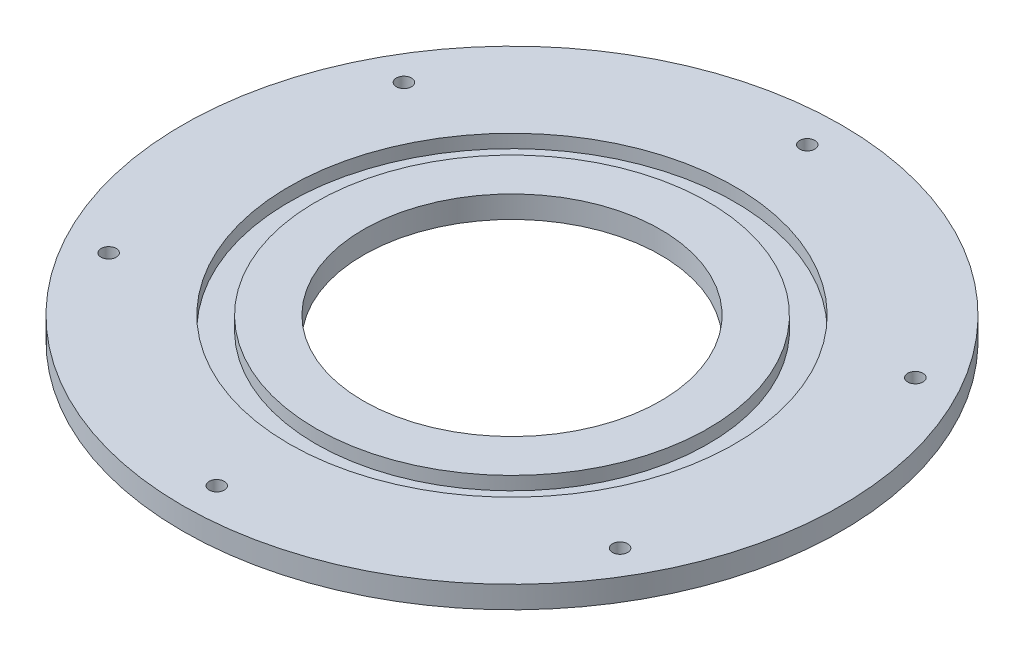
ISO-10303-21;
HEADER;
FILE_DESCRIPTION(('STEP AP214'),'2;1');
FILE_NAME('part.step','',(''),(''),'','','');
FILE_SCHEMA(('AUTOMOTIVE_DESIGN { 1 0 10303 214 1 1 1 1 }'));
ENDSEC;
DATA;
#1=APPLICATION_CONTEXT('core data for automotive mechanical design processes');
#2=APPLICATION_PROTOCOL_DEFINITION('international standard','automotive_design',2000,#1);
#3=PRODUCT_CONTEXT('',#1,'mechanical');
#4=PRODUCT('Part','Part','',(#3));
#5=PRODUCT_RELATED_PRODUCT_CATEGORY('part','',(#4));
#6=PRODUCT_DEFINITION_FORMATION('','',#4);
#7=PRODUCT_DEFINITION_CONTEXT('part definition',#1,'design');
#8=PRODUCT_DEFINITION('design','',#6,#7);
#9=PRODUCT_DEFINITION_SHAPE('','',#8);
#10=(LENGTH_UNIT() NAMED_UNIT(*) SI_UNIT(.MILLI.,.METRE.));
#11=(NAMED_UNIT(*) PLANE_ANGLE_UNIT() SI_UNIT($,.RADIAN.));
#12=(NAMED_UNIT(*) SI_UNIT($,.STERADIAN.) SOLID_ANGLE_UNIT());
#13=UNCERTAINTY_MEASURE_WITH_UNIT(LENGTH_MEASURE(1.E-05),#10,'distance_accuracy_value','');
#14=(GEOMETRIC_REPRESENTATION_CONTEXT(3) GLOBAL_UNCERTAINTY_ASSIGNED_CONTEXT((#13)) GLOBAL_UNIT_ASSIGNED_CONTEXT((#10,
#11,#12)) REPRESENTATION_CONTEXT('',''));
#15=CARTESIAN_POINT('',(0.,0.,0.));
#16=DIRECTION('',(0.,0.,1.));
#17=DIRECTION('',(1.,0.,0.));
#18=AXIS2_PLACEMENT_3D('',#15,#16,#17);
#19=CARTESIAN_POINT('',(0.,5.8,0.));
#20=DIRECTION('',(0.,1.,0.));
#21=DIRECTION('',(0.,0.,1.));
#22=AXIS2_PLACEMENT_3D('',#19,#20,#21);
#23=PLANE('',#22);
#24=CARTESIAN_POINT('',(0.,5.8,0.));
#25=DIRECTION('',(0.,1.,0.));
#26=DIRECTION('',(0.,0.,1.));
#27=AXIS2_PLACEMENT_3D('',#24,#25,#26);
#28=CIRCLE('',#27,39.);
#29=CARTESIAN_POINT('',(0.,5.8,39.));
#30=VERTEX_POINT('',#29);
#31=EDGE_CURVE('E43',#30,#30,#28,.T.);
#32=ORIENTED_EDGE('',*,*,#31,.F.);
#33=EDGE_LOOP('',(#32));
#34=FACE_BOUND('',#33,.T.);
#35=CARTESIAN_POINT('',(0.,5.8,0.));
#36=DIRECTION('',(0.,1.,0.));
#37=DIRECTION('',(0.,0.,1.));
#38=AXIS2_PLACEMENT_3D('',#35,#36,#37);
#39=CIRCLE('',#38,51.5);
#40=CARTESIAN_POINT('',(0.,5.8,51.5));
#41=VERTEX_POINT('',#40);
#42=EDGE_CURVE('E57',#41,#41,#39,.T.);
#43=ORIENTED_EDGE('',*,*,#42,.T.);
#44=EDGE_LOOP('',(#43));
#45=FACE_BOUND('',#44,.T.);
#46=ADVANCED_FACE('F32',(#34,#45),#23,.T.);
#47=CARTESIAN_POINT('',(0.,5.8,-77.5));
#48=DIRECTION('',(0.,1.,0.));
#49=DIRECTION('',(0.,0.,1.));
#50=AXIS2_PLACEMENT_3D('',#47,#48,#49);
#51=CIRCLE('',#50,2.);
#52=CARTESIAN_POINT('',(0.,5.8,-75.5));
#53=VERTEX_POINT('',#52);
#54=EDGE_CURVE('E88',#53,#53,#51,.T.);
#55=ORIENTED_EDGE('',*,*,#54,.F.);
#56=EDGE_LOOP('',(#55));
#57=FACE_BOUND('',#56,.T.);
#58=CARTESIAN_POINT('',(-67.1169687932928,5.8,-38.7499999999979));
#59=DIRECTION('',(0.,1.,0.));
#60=DIRECTION('',(0.,0.,1.));
#61=AXIS2_PLACEMENT_3D('',#58,#59,#60);
#62=CIRCLE('',#61,2.);
#63=CARTESIAN_POINT('',(-67.1169687932928,5.8,-36.7499999999979));
#64=VERTEX_POINT('',#63);
#65=EDGE_CURVE('E89',#64,#64,#62,.T.);
#66=ORIENTED_EDGE('',*,*,#65,.F.);
#67=EDGE_LOOP('',(#66));
#68=FACE_BOUND('',#67,.T.);
#69=CARTESIAN_POINT('',(-67.1169687932904,5.8,38.7500000000021));
#70=DIRECTION('',(0.,1.,0.));
#71=DIRECTION('',(0.,0.,1.));
#72=AXIS2_PLACEMENT_3D('',#69,#70,#71);
#73=CIRCLE('',#72,2.);
#74=CARTESIAN_POINT('',(-67.1169687932904,5.8,40.7500000000021));
#75=VERTEX_POINT('',#74);
#76=EDGE_CURVE('E63',#75,#75,#73,.T.);
#77=ORIENTED_EDGE('',*,*,#76,.F.);
#78=EDGE_LOOP('',(#77));
#79=FACE_BOUND('',#78,.T.);
#80=CARTESIAN_POINT('',(4.82556736917295E-12,5.8,77.5));
#81=DIRECTION('',(0.,1.,0.));
#82=DIRECTION('',(0.,0.,1.));
#83=AXIS2_PLACEMENT_3D('',#80,#81,#82);
#84=CIRCLE('',#83,2.);
#85=CARTESIAN_POINT('',(4.82556736917295E-12,5.8,79.5));
#86=VERTEX_POINT('',#85);
#87=EDGE_CURVE('E70',#86,#86,#84,.T.);
#88=ORIENTED_EDGE('',*,*,#87,.F.);
#89=EDGE_LOOP('',(#88));
#90=FACE_BOUND('',#89,.T.);
#91=CARTESIAN_POINT('',(67.1169687932976,5.8,38.7499999999979));
#92=DIRECTION('',(0.,1.,0.));
#93=DIRECTION('',(0.,0.,1.));
#94=AXIS2_PLACEMENT_3D('',#91,#92,#93);
#95=CIRCLE('',#94,2.);
#96=CARTESIAN_POINT('',(67.1169687932976,5.8,40.7499999999979));
#97=VERTEX_POINT('',#96);
#98=EDGE_CURVE('E76',#97,#97,#95,.T.);
#99=ORIENTED_EDGE('',*,*,#98,.F.);
#100=EDGE_LOOP('',(#99));
#101=FACE_BOUND('',#100,.T.);
#102=CARTESIAN_POINT('',(67.1169687932952,5.8,-38.7500000000021));
#103=DIRECTION('',(0.,1.,0.));
#104=DIRECTION('',(0.,0.,1.));
#105=AXIS2_PLACEMENT_3D('',#102,#103,#104);
#106=CIRCLE('',#105,2.);
#107=CARTESIAN_POINT('',(67.1169687932952,5.8,-36.7500000000021));
#108=VERTEX_POINT('',#107);
#109=EDGE_CURVE('E82',#108,#108,#106,.T.);
#110=ORIENTED_EDGE('',*,*,#109,.F.);
#111=EDGE_LOOP('',(#110));
#112=FACE_BOUND('',#111,.T.);
#113=CARTESIAN_POINT('',(0.,5.8,0.));
#114=DIRECTION('',(0.,1.,0.));
#115=DIRECTION('',(0.,0.,1.));
#116=AXIS2_PLACEMENT_3D('',#113,#114,#115);
#117=CIRCLE('',#116,58.5);
#118=CARTESIAN_POINT('',(0.,5.8,58.5));
#119=VERTEX_POINT('',#118);
#120=EDGE_CURVE('E51',#119,#119,#117,.T.);
#121=ORIENTED_EDGE('',*,*,#120,.F.);
#122=EDGE_LOOP('',(#121));
#123=FACE_BOUND('',#122,.T.);
#124=CARTESIAN_POINT('',(0.,5.8,0.));
#125=DIRECTION('',(0.,1.,0.));
#126=DIRECTION('',(0.,0.,1.));
#127=AXIS2_PLACEMENT_3D('',#124,#125,#126);
#128=CIRCLE('',#127,86.5);
#129=CARTESIAN_POINT('',(0.,5.8,86.5));
#130=VERTEX_POINT('',#129);
#131=EDGE_CURVE('E10',#130,#130,#128,.T.);
#132=ORIENTED_EDGE('',*,*,#131,.T.);
#133=EDGE_LOOP('',(#132));
#134=FACE_BOUND('',#133,.T.);
#135=ADVANCED_FACE('F109',(#57,#68,#79,#90,#101,#112,#123,#134),#23,.T.);
#136=CARTESIAN_POINT('',(0.,0.,0.));
#137=DIRECTION('',(0.,1.,0.));
#138=DIRECTION('',(0.,0.,1.));
#139=AXIS2_PLACEMENT_3D('',#136,#137,#138);
#140=PLANE('',#139);
#141=CARTESIAN_POINT('',(0.,0.,-77.5));
#142=DIRECTION('',(0.,1.,0.));
#143=DIRECTION('',(0.,0.,1.));
#144=AXIS2_PLACEMENT_3D('',#141,#142,#143);
#145=CIRCLE('',#144,2.);
#146=CARTESIAN_POINT('',(0.,0.,-75.5));
#147=VERTEX_POINT('',#146);
#148=EDGE_CURVE('E60',#147,#147,#145,.T.);
#149=ORIENTED_EDGE('',*,*,#148,.T.);
#150=EDGE_LOOP('',(#149));
#151=FACE_BOUND('',#150,.T.);
#152=CARTESIAN_POINT('',(-67.1169687932928,0.,-38.7499999999979));
#153=DIRECTION('',(0.,1.,0.));
#154=DIRECTION('',(0.,0.,1.));
#155=AXIS2_PLACEMENT_3D('',#152,#153,#154);
#156=CIRCLE('',#155,2.);
#157=CARTESIAN_POINT('',(-67.1169687932928,0.,-36.7499999999979));
#158=VERTEX_POINT('',#157);
#159=EDGE_CURVE('E67',#158,#158,#156,.T.);
#160=ORIENTED_EDGE('',*,*,#159,.T.);
#161=EDGE_LOOP('',(#160));
#162=FACE_BOUND('',#161,.T.);
#163=CARTESIAN_POINT('',(-67.1169687932904,0.,38.7500000000021));
#164=DIRECTION('',(0.,1.,0.));
#165=DIRECTION('',(0.,0.,1.));
#166=AXIS2_PLACEMENT_3D('',#163,#164,#165);
#167=CIRCLE('',#166,2.);
#168=CARTESIAN_POINT('',(-67.1169687932904,0.,40.7500000000021));
#169=VERTEX_POINT('',#168);
#170=EDGE_CURVE('E66',#169,#169,#167,.T.);
#171=ORIENTED_EDGE('',*,*,#170,.T.);
#172=EDGE_LOOP('',(#171));
#173=FACE_BOUND('',#172,.T.);
#174=CARTESIAN_POINT('',(4.82556736917295E-12,0.,77.5));
#175=DIRECTION('',(0.,1.,0.));
#176=DIRECTION('',(0.,0.,1.));
#177=AXIS2_PLACEMENT_3D('',#174,#175,#176);
#178=CIRCLE('',#177,2.);
#179=CARTESIAN_POINT('',(4.82556736917295E-12,0.,79.5));
#180=VERTEX_POINT('',#179);
#181=EDGE_CURVE('E73',#180,#180,#178,.T.);
#182=ORIENTED_EDGE('',*,*,#181,.T.);
#183=EDGE_LOOP('',(#182));
#184=FACE_BOUND('',#183,.T.);
#185=CARTESIAN_POINT('',(67.1169687932976,0.,38.7499999999979));
#186=DIRECTION('',(0.,1.,0.));
#187=DIRECTION('',(0.,0.,1.));
#188=AXIS2_PLACEMENT_3D('',#185,#186,#187);
#189=CIRCLE('',#188,2.);
#190=CARTESIAN_POINT('',(67.1169687932976,0.,40.7499999999979));
#191=VERTEX_POINT('',#190);
#192=EDGE_CURVE('E79',#191,#191,#189,.T.);
#193=ORIENTED_EDGE('',*,*,#192,.T.);
#194=EDGE_LOOP('',(#193));
#195=FACE_BOUND('',#194,.T.);
#196=CARTESIAN_POINT('',(67.1169687932952,0.,-38.7500000000021));
#197=DIRECTION('',(0.,1.,0.));
#198=DIRECTION('',(0.,0.,1.));
#199=AXIS2_PLACEMENT_3D('',#196,#197,#198);
#200=CIRCLE('',#199,2.);
#201=CARTESIAN_POINT('',(67.1169687932952,0.,-36.7500000000021));
#202=VERTEX_POINT('',#201);
#203=EDGE_CURVE('E85',#202,#202,#200,.T.);
#204=ORIENTED_EDGE('',*,*,#203,.T.);
#205=EDGE_LOOP('',(#204));
#206=FACE_BOUND('',#205,.T.);
#207=CARTESIAN_POINT('',(0.,0.,0.));
#208=DIRECTION('',(0.,1.,0.));
#209=DIRECTION('',(0.,0.,1.));
#210=AXIS2_PLACEMENT_3D('',#207,#208,#209);
#211=CIRCLE('',#210,86.5);
#212=CARTESIAN_POINT('',(0.,0.,86.5));
#213=VERTEX_POINT('',#212);
#214=EDGE_CURVE('E36',#213,#213,#211,.T.);
#215=ORIENTED_EDGE('',*,*,#214,.F.);
#216=EDGE_LOOP('',(#215));
#217=FACE_BOUND('',#216,.T.);
#218=CARTESIAN_POINT('',(0.,0.,0.));
#219=DIRECTION('',(0.,1.,0.));
#220=DIRECTION('',(0.,0.,1.));
#221=AXIS2_PLACEMENT_3D('',#218,#219,#220);
#222=CIRCLE('',#221,39.);
#223=CARTESIAN_POINT('',(0.,0.,39.));
#224=VERTEX_POINT('',#223);
#225=EDGE_CURVE('E45',#224,#224,#222,.T.);
#226=ORIENTED_EDGE('',*,*,#225,.T.);
#227=EDGE_LOOP('',(#226));
#228=FACE_BOUND('',#227,.T.);
#229=ADVANCED_FACE('F99',(#151,#162,#173,#184,#195,#206,#217,#228),#140,.F.);
#230=CARTESIAN_POINT('',(0.,5.8,0.));
#231=DIRECTION('',(0.,-1.,0.));
#232=DIRECTION('',(0.,0.,-1.));
#233=AXIS2_PLACEMENT_3D('',#230,#231,#232);
#234=CYLINDRICAL_SURFACE('',#233,86.5);
#235=ORIENTED_EDGE('',*,*,#131,.F.);
#236=EDGE_LOOP('',(#235));
#237=FACE_BOUND('',#236,.T.);
#238=ORIENTED_EDGE('',*,*,#214,.T.);
#239=EDGE_LOOP('',(#238));
#240=FACE_BOUND('',#239,.T.);
#241=ADVANCED_FACE('F34',(#237,#240),#234,.T.);
#242=CARTESIAN_POINT('',(0.,5.8,0.));
#243=DIRECTION('',(0.,-1.,0.));
#244=DIRECTION('',(0.,0.,-1.));
#245=AXIS2_PLACEMENT_3D('',#242,#243,#244);
#246=CYLINDRICAL_SURFACE('',#245,39.);
#247=ORIENTED_EDGE('',*,*,#31,.T.);
#248=EDGE_LOOP('',(#247));
#249=FACE_BOUND('',#248,.T.);
#250=ORIENTED_EDGE('',*,*,#225,.F.);
#251=EDGE_LOOP('',(#250));
#252=FACE_BOUND('',#251,.T.);
#253=ADVANCED_FACE('F128',(#249,#252),#246,.F.);
#254=CARTESIAN_POINT('',(0.,2.3,0.));
#255=DIRECTION('',(0.,1.,0.));
#256=DIRECTION('',(0.,0.,1.));
#257=AXIS2_PLACEMENT_3D('',#254,#255,#256);
#258=CYLINDRICAL_SURFACE('',#257,58.5);
#259=CARTESIAN_POINT('',(0.,2.3,0.));
#260=DIRECTION('',(0.,1.,0.));
#261=DIRECTION('',(0.,0.,1.));
#262=AXIS2_PLACEMENT_3D('',#259,#260,#261);
#263=CIRCLE('',#262,58.5);
#264=CARTESIAN_POINT('',(0.,2.3,58.5));
#265=VERTEX_POINT('',#264);
#266=EDGE_CURVE('E48',#265,#265,#263,.T.);
#267=ORIENTED_EDGE('',*,*,#266,.F.);
#268=EDGE_LOOP('',(#267));
#269=FACE_BOUND('',#268,.T.);
#270=ORIENTED_EDGE('',*,*,#120,.T.);
#271=EDGE_LOOP('',(#270));
#272=FACE_BOUND('',#271,.T.);
#273=ADVANCED_FACE('F125',(#269,#272),#258,.F.);
#274=CARTESIAN_POINT('',(0.,2.3,0.));
#275=DIRECTION('',(0.,1.,0.));
#276=DIRECTION('',(0.,0.,1.));
#277=AXIS2_PLACEMENT_3D('',#274,#275,#276);
#278=PLANE('',#277);
#279=CARTESIAN_POINT('',(0.,2.3,0.));
#280=DIRECTION('',(0.,1.,0.));
#281=DIRECTION('',(0.,0.,1.));
#282=AXIS2_PLACEMENT_3D('',#279,#280,#281);
#283=CIRCLE('',#282,51.5);
#284=CARTESIAN_POINT('',(0.,2.3,51.5));
#285=VERTEX_POINT('',#284);
#286=EDGE_CURVE('E54',#285,#285,#283,.T.);
#287=ORIENTED_EDGE('',*,*,#286,.F.);
#288=EDGE_LOOP('',(#287));
#289=FACE_BOUND('',#288,.T.);
#290=ORIENTED_EDGE('',*,*,#266,.T.);
#291=EDGE_LOOP('',(#290));
#292=FACE_BOUND('',#291,.T.);
#293=ADVANCED_FACE('F127',(#289,#292),#278,.T.);
#294=CARTESIAN_POINT('',(0.,2.3,0.));
#295=DIRECTION('',(0.,1.,0.));
#296=DIRECTION('',(0.,0.,1.));
#297=AXIS2_PLACEMENT_3D('',#294,#295,#296);
#298=CYLINDRICAL_SURFACE('',#297,51.5);
#299=ORIENTED_EDGE('',*,*,#286,.T.);
#300=EDGE_LOOP('',(#299));
#301=FACE_BOUND('',#300,.T.);
#302=ORIENTED_EDGE('',*,*,#42,.F.);
#303=EDGE_LOOP('',(#302));
#304=FACE_BOUND('',#303,.T.);
#305=ADVANCED_FACE('F135',(#301,#304),#298,.T.);
#306=CARTESIAN_POINT('',(67.1169687932952,0.,-38.7500000000021));
#307=DIRECTION('',(0.,1.,0.));
#308=DIRECTION('',(0.,0.,1.));
#309=AXIS2_PLACEMENT_3D('',#306,#307,#308);
#310=CYLINDRICAL_SURFACE('',#309,2.);
#311=ORIENTED_EDGE('',*,*,#203,.F.);
#312=EDGE_LOOP('',(#311));
#313=FACE_BOUND('',#312,.T.);
#314=ORIENTED_EDGE('',*,*,#109,.T.);
#315=EDGE_LOOP('',(#314));
#316=FACE_BOUND('',#315,.T.);
#317=ADVANCED_FACE('F187',(#313,#316),#310,.F.);
#318=CARTESIAN_POINT('',(67.1169687932976,0.,38.7499999999979));
#319=DIRECTION('',(0.,1.,0.));
#320=DIRECTION('',(0.,0.,1.));
#321=AXIS2_PLACEMENT_3D('',#318,#319,#320);
#322=CYLINDRICAL_SURFACE('',#321,2.);
#323=ORIENTED_EDGE('',*,*,#192,.F.);
#324=EDGE_LOOP('',(#323));
#325=FACE_BOUND('',#324,.T.);
#326=ORIENTED_EDGE('',*,*,#98,.T.);
#327=EDGE_LOOP('',(#326));
#328=FACE_BOUND('',#327,.T.);
#329=ADVANCED_FACE('F207',(#325,#328),#322,.F.);
#330=CARTESIAN_POINT('',(4.82556736917295E-12,0.,77.5));
#331=DIRECTION('',(0.,1.,0.));
#332=DIRECTION('',(0.,0.,1.));
#333=AXIS2_PLACEMENT_3D('',#330,#331,#332);
#334=CYLINDRICAL_SURFACE('',#333,2.);
#335=ORIENTED_EDGE('',*,*,#181,.F.);
#336=EDGE_LOOP('',(#335));
#337=FACE_BOUND('',#336,.T.);
#338=ORIENTED_EDGE('',*,*,#87,.T.);
#339=EDGE_LOOP('',(#338));
#340=FACE_BOUND('',#339,.T.);
#341=ADVANCED_FACE('F217',(#337,#340),#334,.F.);
#342=CARTESIAN_POINT('',(-67.1169687932904,0.,38.7500000000021));
#343=DIRECTION('',(0.,1.,0.));
#344=DIRECTION('',(0.,0.,1.));
#345=AXIS2_PLACEMENT_3D('',#342,#343,#344);
#346=CYLINDRICAL_SURFACE('',#345,2.);
#347=ORIENTED_EDGE('',*,*,#170,.F.);
#348=EDGE_LOOP('',(#347));
#349=FACE_BOUND('',#348,.T.);
#350=ORIENTED_EDGE('',*,*,#76,.T.);
#351=EDGE_LOOP('',(#350));
#352=FACE_BOUND('',#351,.T.);
#353=ADVANCED_FACE('F227',(#349,#352),#346,.F.);
#354=CARTESIAN_POINT('',(-67.1169687932928,0.,-38.7499999999979));
#355=DIRECTION('',(0.,1.,0.));
#356=DIRECTION('',(0.,0.,1.));
#357=AXIS2_PLACEMENT_3D('',#354,#355,#356);
#358=CYLINDRICAL_SURFACE('',#357,2.);
#359=ORIENTED_EDGE('',*,*,#159,.F.);
#360=EDGE_LOOP('',(#359));
#361=FACE_BOUND('',#360,.T.);
#362=ORIENTED_EDGE('',*,*,#65,.T.);
#363=EDGE_LOOP('',(#362));
#364=FACE_BOUND('',#363,.T.);
#365=ADVANCED_FACE('F105',(#361,#364),#358,.F.);
#366=CARTESIAN_POINT('',(0.,0.,-77.5));
#367=DIRECTION('',(0.,1.,0.));
#368=DIRECTION('',(0.,0.,1.));
#369=AXIS2_PLACEMENT_3D('',#366,#367,#368);
#370=CYLINDRICAL_SURFACE('',#369,2.);
#371=ORIENTED_EDGE('',*,*,#148,.F.);
#372=EDGE_LOOP('',(#371));
#373=FACE_BOUND('',#372,.T.);
#374=ORIENTED_EDGE('',*,*,#54,.T.);
#375=EDGE_LOOP('',(#374));
#376=FACE_BOUND('',#375,.T.);
#377=ADVANCED_FACE('F102',(#373,#376),#370,.F.);
#378=CLOSED_SHELL('',(#46,#135,#229,#241,#253,#273,#293,#305,#317,#329,#341,#353,#365,#377));
#379=MANIFOLD_SOLID_BREP('B2',#378);
#380=ADVANCED_BREP_SHAPE_REPRESENTATION('',(#18,#379),#14);
#381=SHAPE_DEFINITION_REPRESENTATION(#9,#380);
ENDSEC;
END-ISO-10303-21;
